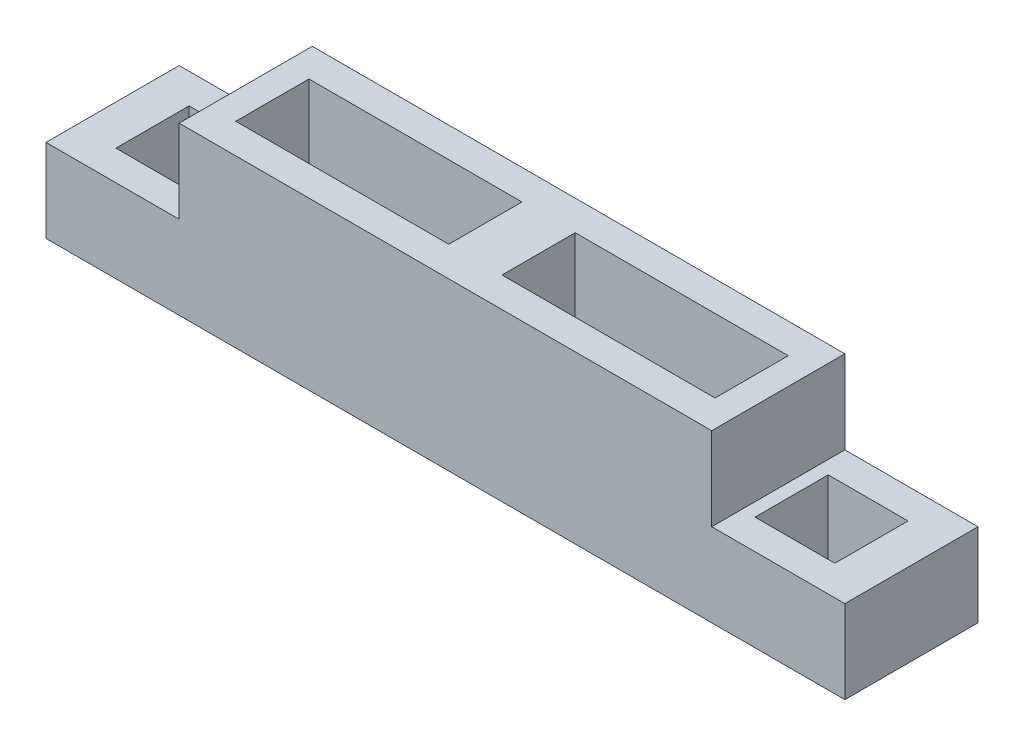
ISO-10303-21;
HEADER;
FILE_DESCRIPTION(('STEP AP214'),'2;1');
FILE_NAME('part.step','',(''),(''),'','','');
FILE_SCHEMA(('AUTOMOTIVE_DESIGN { 1 0 10303 214 1 1 1 1 }'));
ENDSEC;
DATA;
#1=APPLICATION_CONTEXT('core data for automotive mechanical design processes');
#2=APPLICATION_PROTOCOL_DEFINITION('international standard','automotive_design',2000,#1);
#3=PRODUCT_CONTEXT('',#1,'mechanical');
#4=PRODUCT('Part','Part','',(#3));
#5=PRODUCT_RELATED_PRODUCT_CATEGORY('part','',(#4));
#6=PRODUCT_DEFINITION_FORMATION('','',#4);
#7=PRODUCT_DEFINITION_CONTEXT('part definition',#1,'design');
#8=PRODUCT_DEFINITION('design','',#6,#7);
#9=PRODUCT_DEFINITION_SHAPE('','',#8);
#10=(LENGTH_UNIT() NAMED_UNIT(*) SI_UNIT(.MILLI.,.METRE.));
#11=(NAMED_UNIT(*) PLANE_ANGLE_UNIT() SI_UNIT($,.RADIAN.));
#12=(NAMED_UNIT(*) SI_UNIT($,.STERADIAN.) SOLID_ANGLE_UNIT());
#13=UNCERTAINTY_MEASURE_WITH_UNIT(LENGTH_MEASURE(1.E-05),#10,'distance_accuracy_value','');
#14=(GEOMETRIC_REPRESENTATION_CONTEXT(3) GLOBAL_UNCERTAINTY_ASSIGNED_CONTEXT((#13)) GLOBAL_UNIT_ASSIGNED_CONTEXT((#10,
#11,#12)) REPRESENTATION_CONTEXT('',''));
#15=CARTESIAN_POINT('',(0.,0.,0.));
#16=DIRECTION('',(0.,0.,1.));
#17=DIRECTION('',(1.,0.,0.));
#18=AXIS2_PLACEMENT_3D('',#15,#16,#17);
#19=CARTESIAN_POINT('',(0.,250.,0.));
#20=DIRECTION('',(0.,1.,0.));
#21=DIRECTION('',(0.,0.,1.));
#22=AXIS2_PLACEMENT_3D('',#19,#20,#21);
#23=PLANE('',#22);
#24=DIRECTION('',(0.,0.,1.));
#25=VECTOR('',#24,1.);
#26=CARTESIAN_POINT('',(-400.,250.,-100.));
#27=LINE('',#26,#25);
#28=CARTESIAN_POINT('',(-400.,250.,-100.));
#29=VERTEX_POINT('',#28);
#30=CARTESIAN_POINT('',(-400.,250.,100.));
#31=VERTEX_POINT('',#30);
#32=EDGE_CURVE('E247',#29,#31,#27,.T.);
#33=ORIENTED_EDGE('',*,*,#32,.T.);
#34=DIRECTION('',(1.,0.,0.));
#35=VECTOR('',#34,1.);
#36=CARTESIAN_POINT('',(-600.,250.,100.));
#37=LINE('',#36,#35);
#38=CARTESIAN_POINT('',(400.,250.,100.));
#39=VERTEX_POINT('',#38);
#40=EDGE_CURVE('E347',#31,#39,#37,.T.);
#41=ORIENTED_EDGE('',*,*,#40,.T.);
#42=DIRECTION('',(0.,0.,1.));
#43=VECTOR('',#42,1.);
#44=CARTESIAN_POINT('',(400.,250.,-100.));
#45=LINE('',#44,#43);
#46=CARTESIAN_POINT('',(400.,250.,-100.));
#47=VERTEX_POINT('',#46);
#48=EDGE_CURVE('E62',#47,#39,#45,.T.);
#49=ORIENTED_EDGE('',*,*,#48,.F.);
#50=DIRECTION('',(-1.,0.,0.));
#51=VECTOR('',#50,1.);
#52=CARTESIAN_POINT('',(-600.,250.,-99.9999999999999));
#53=LINE('',#52,#51);
#54=EDGE_CURVE('E344',#47,#29,#53,.T.);
#55=ORIENTED_EDGE('',*,*,#54,.T.);
#56=EDGE_LOOP('',(#33,#41,#49,#55));
#57=FACE_BOUND('',#56,.T.);
#58=DIRECTION('',(-1.,0.,0.));
#59=VECTOR('',#58,1.);
#60=CARTESIAN_POINT('',(-360.,250.,-55.));
#61=LINE('',#60,#59);
#62=CARTESIAN_POINT('',(-40.0000000000001,250.,-55.));
#63=VERTEX_POINT('',#62);
#64=CARTESIAN_POINT('',(-360.,250.,-55.));
#65=VERTEX_POINT('',#64);
#66=EDGE_CURVE('E295',#63,#65,#61,.T.);
#67=ORIENTED_EDGE('',*,*,#66,.F.);
#68=DIRECTION('',(0.,0.,-1.));
#69=VECTOR('',#68,1.);
#70=CARTESIAN_POINT('',(-40.0000000000001,250.,-55.));
#71=LINE('',#70,#69);
#72=CARTESIAN_POINT('',(-40.0000000000001,250.,55.));
#73=VERTEX_POINT('',#72);
#74=EDGE_CURVE('E293',#73,#63,#71,.T.);
#75=ORIENTED_EDGE('',*,*,#74,.F.);
#76=DIRECTION('',(1.,0.,0.));
#77=VECTOR('',#76,1.);
#78=CARTESIAN_POINT('',(-360.,250.,55.));
#79=LINE('',#78,#77);
#80=CARTESIAN_POINT('',(-360.,250.,55.));
#81=VERTEX_POINT('',#80);
#82=EDGE_CURVE('E301',#81,#73,#79,.T.);
#83=ORIENTED_EDGE('',*,*,#82,.F.);
#84=DIRECTION('',(0.,0.,1.));
#85=VECTOR('',#84,1.);
#86=CARTESIAN_POINT('',(-360.,250.,-55.));
#87=LINE('',#86,#85);
#88=EDGE_CURVE('E298',#65,#81,#87,.T.);
#89=ORIENTED_EDGE('',*,*,#88,.F.);
#90=EDGE_LOOP('',(#67,#75,#83,#89));
#91=FACE_BOUND('',#90,.T.);
#92=DIRECTION('',(-1.,0.,0.));
#93=VECTOR('',#92,1.);
#94=CARTESIAN_POINT('',(360.,250.,-55.));
#95=LINE('',#94,#93);
#96=CARTESIAN_POINT('',(360.,250.,-55.));
#97=VERTEX_POINT('',#96);
#98=CARTESIAN_POINT('',(40.0000000000001,250.,-55.));
#99=VERTEX_POINT('',#98);
#100=EDGE_CURVE('E264',#97,#99,#95,.T.);
#101=ORIENTED_EDGE('',*,*,#100,.F.);
#102=DIRECTION('',(0.,0.,-1.));
#103=VECTOR('',#102,1.);
#104=CARTESIAN_POINT('',(360.,250.,-55.));
#105=LINE('',#104,#103);
#106=CARTESIAN_POINT('',(360.,250.,55.));
#107=VERTEX_POINT('',#106);
#108=EDGE_CURVE('E262',#107,#97,#105,.T.);
#109=ORIENTED_EDGE('',*,*,#108,.F.);
#110=DIRECTION('',(1.,0.,0.));
#111=VECTOR('',#110,1.);
#112=CARTESIAN_POINT('',(360.,250.,55.));
#113=LINE('',#112,#111);
#114=CARTESIAN_POINT('',(40.0000000000001,250.,55.));
#115=VERTEX_POINT('',#114);
#116=EDGE_CURVE('E270',#115,#107,#113,.T.);
#117=ORIENTED_EDGE('',*,*,#116,.F.);
#118=DIRECTION('',(0.,0.,1.));
#119=VECTOR('',#118,1.);
#120=CARTESIAN_POINT('',(40.0000000000001,250.,-55.));
#121=LINE('',#120,#119);
#122=EDGE_CURVE('E267',#99,#115,#121,.T.);
#123=ORIENTED_EDGE('',*,*,#122,.F.);
#124=EDGE_LOOP('',(#101,#109,#117,#123));
#125=FACE_BOUND('',#124,.T.);
#126=ADVANCED_FACE('F39',(#57,#91,#125),#23,.T.);
#127=CARTESIAN_POINT('',(0.,0.,0.));
#128=DIRECTION('',(0.,1.,0.));
#129=DIRECTION('',(0.,0.,1.));
#130=AXIS2_PLACEMENT_3D('',#127,#128,#129);
#131=PLANE('',#130);
#132=DIRECTION('',(0.,0.,-1.));
#133=VECTOR('',#132,1.);
#134=CARTESIAN_POINT('',(360.,0.,-55.));
#135=LINE('',#134,#133);
#136=CARTESIAN_POINT('',(360.,0.,55.));
#137=VERTEX_POINT('',#136);
#138=CARTESIAN_POINT('',(360.,0.,-55.));
#139=VERTEX_POINT('',#138);
#140=EDGE_CURVE('E261',#137,#139,#135,.T.);
#141=ORIENTED_EDGE('',*,*,#140,.T.);
#142=DIRECTION('',(-1.,0.,0.));
#143=VECTOR('',#142,1.);
#144=CARTESIAN_POINT('',(360.,0.,-55.));
#145=LINE('',#144,#143);
#146=CARTESIAN_POINT('',(40.0000000000001,0.,-55.));
#147=VERTEX_POINT('',#146);
#148=EDGE_CURVE('E275',#139,#147,#145,.T.);
#149=ORIENTED_EDGE('',*,*,#148,.T.);
#150=DIRECTION('',(0.,0.,1.));
#151=VECTOR('',#150,1.);
#152=CARTESIAN_POINT('',(40.0000000000001,0.,-55.));
#153=LINE('',#152,#151);
#154=CARTESIAN_POINT('',(40.0000000000001,0.,55.));
#155=VERTEX_POINT('',#154);
#156=EDGE_CURVE('E278',#147,#155,#153,.T.);
#157=ORIENTED_EDGE('',*,*,#156,.T.);
#158=DIRECTION('',(1.,0.,0.));
#159=VECTOR('',#158,1.);
#160=CARTESIAN_POINT('',(360.,0.,55.));
#161=LINE('',#160,#159);
#162=EDGE_CURVE('E265',#155,#137,#161,.T.);
#163=ORIENTED_EDGE('',*,*,#162,.T.);
#164=EDGE_LOOP('',(#141,#149,#157,#163));
#165=FACE_BOUND('',#164,.T.);
#166=DIRECTION('',(0.,0.,-1.));
#167=VECTOR('',#166,1.);
#168=CARTESIAN_POINT('',(-420.,0.,-55.));
#169=LINE('',#168,#167);
#170=CARTESIAN_POINT('',(-420.,0.,55.));
#171=VERTEX_POINT('',#170);
#172=CARTESIAN_POINT('',(-420.,0.,-55.));
#173=VERTEX_POINT('',#172);
#174=EDGE_CURVE('E323',#171,#173,#169,.T.);
#175=ORIENTED_EDGE('',*,*,#174,.T.);
#176=DIRECTION('',(-1.,0.,0.));
#177=VECTOR('',#176,1.);
#178=CARTESIAN_POINT('',(-540.,0.,-55.));
#179=LINE('',#178,#177);
#180=CARTESIAN_POINT('',(-540.,0.,-55.));
#181=VERTEX_POINT('',#180);
#182=EDGE_CURVE('E326',#173,#181,#179,.T.);
#183=ORIENTED_EDGE('',*,*,#182,.T.);
#184=DIRECTION('',(0.,0.,1.));
#185=VECTOR('',#184,1.);
#186=CARTESIAN_POINT('',(-540.,0.,-55.));
#187=LINE('',#186,#185);
#188=CARTESIAN_POINT('',(-540.,0.,55.));
#189=VERTEX_POINT('',#188);
#190=EDGE_CURVE('E329',#181,#189,#187,.T.);
#191=ORIENTED_EDGE('',*,*,#190,.T.);
#192=DIRECTION('',(1.,0.,0.));
#193=VECTOR('',#192,1.);
#194=CARTESIAN_POINT('',(-540.,0.,55.));
#195=LINE('',#194,#193);
#196=EDGE_CURVE('E332',#189,#171,#195,.T.);
#197=ORIENTED_EDGE('',*,*,#196,.T.);
#198=EDGE_LOOP('',(#175,#183,#191,#197));
#199=FACE_BOUND('',#198,.T.);
#200=DIRECTION('',(0.,0.,-1.));
#201=VECTOR('',#200,1.);
#202=CARTESIAN_POINT('',(600.,0.,-100.));
#203=LINE('',#202,#201);
#204=CARTESIAN_POINT('',(600.,0.,99.9999999999999));
#205=VERTEX_POINT('',#204);
#206=CARTESIAN_POINT('',(600.,0.,-100.));
#207=VERTEX_POINT('',#206);
#208=EDGE_CURVE('E343',#205,#207,#203,.T.);
#209=ORIENTED_EDGE('',*,*,#208,.F.);
#210=DIRECTION('',(1.,0.,0.));
#211=VECTOR('',#210,1.);
#212=CARTESIAN_POINT('',(-600.,0.,100.));
#213=LINE('',#212,#211);
#214=CARTESIAN_POINT('',(-600.,0.,100.));
#215=VERTEX_POINT('',#214);
#216=EDGE_CURVE('E348',#215,#205,#213,.T.);
#217=ORIENTED_EDGE('',*,*,#216,.F.);
#218=DIRECTION('',(0.,0.,1.));
#219=VECTOR('',#218,1.);
#220=CARTESIAN_POINT('',(-600.,0.,-99.9999999999999));
#221=LINE('',#220,#219);
#222=CARTESIAN_POINT('',(-600.,0.,-99.9999999999999));
#223=VERTEX_POINT('',#222);
#224=EDGE_CURVE('E354',#223,#215,#221,.T.);
#225=ORIENTED_EDGE('',*,*,#224,.F.);
#226=DIRECTION('',(-1.,0.,0.));
#227=VECTOR('',#226,1.);
#228=CARTESIAN_POINT('',(-600.,0.,-99.9999999999999));
#229=LINE('',#228,#227);
#230=EDGE_CURVE('E219',#207,#223,#229,.T.);
#231=ORIENTED_EDGE('',*,*,#230,.F.);
#232=EDGE_LOOP('',(#209,#217,#225,#231));
#233=FACE_BOUND('',#232,.T.);
#234=DIRECTION('',(0.,0.,-1.));
#235=VECTOR('',#234,1.);
#236=CARTESIAN_POINT('',(-40.0000000000001,0.,-55.));
#237=LINE('',#236,#235);
#238=CARTESIAN_POINT('',(-40.0000000000001,0.,55.));
#239=VERTEX_POINT('',#238);
#240=CARTESIAN_POINT('',(-40.0000000000001,0.,-55.));
#241=VERTEX_POINT('',#240);
#242=EDGE_CURVE('E292',#239,#241,#237,.T.);
#243=ORIENTED_EDGE('',*,*,#242,.T.);
#244=DIRECTION('',(-1.,0.,0.));
#245=VECTOR('',#244,1.);
#246=CARTESIAN_POINT('',(-360.,0.,-55.));
#247=LINE('',#246,#245);
#248=CARTESIAN_POINT('',(-360.,0.,-55.));
#249=VERTEX_POINT('',#248);
#250=EDGE_CURVE('E306',#241,#249,#247,.T.);
#251=ORIENTED_EDGE('',*,*,#250,.T.);
#252=DIRECTION('',(0.,0.,1.));
#253=VECTOR('',#252,1.);
#254=CARTESIAN_POINT('',(-360.,0.,-55.));
#255=LINE('',#254,#253);
#256=CARTESIAN_POINT('',(-360.,0.,55.));
#257=VERTEX_POINT('',#256);
#258=EDGE_CURVE('E309',#249,#257,#255,.T.);
#259=ORIENTED_EDGE('',*,*,#258,.T.);
#260=DIRECTION('',(1.,0.,0.));
#261=VECTOR('',#260,1.);
#262=CARTESIAN_POINT('',(-360.,0.,55.));
#263=LINE('',#262,#261);
#264=EDGE_CURVE('E296',#257,#239,#263,.T.);
#265=ORIENTED_EDGE('',*,*,#264,.T.);
#266=EDGE_LOOP('',(#243,#251,#259,#265));
#267=FACE_BOUND('',#266,.T.);
#268=DIRECTION('',(0.,0.,-1.));
#269=VECTOR('',#268,1.);
#270=CARTESIAN_POINT('',(540.,0.,-55.));
#271=LINE('',#270,#269);
#272=CARTESIAN_POINT('',(540.,0.,55.));
#273=VERTEX_POINT('',#272);
#274=CARTESIAN_POINT('',(540.,0.,-55.));
#275=VERTEX_POINT('',#274);
#276=EDGE_CURVE('E378',#273,#275,#271,.T.);
#277=ORIENTED_EDGE('',*,*,#276,.T.);
#278=DIRECTION('',(-1.,0.,0.));
#279=VECTOR('',#278,1.);
#280=CARTESIAN_POINT('',(540.,0.,-55.));
#281=LINE('',#280,#279);
#282=CARTESIAN_POINT('',(420.,0.,-55.));
#283=VERTEX_POINT('',#282);
#284=EDGE_CURVE('E380',#275,#283,#281,.T.);
#285=ORIENTED_EDGE('',*,*,#284,.T.);
#286=DIRECTION('',(0.,0.,1.));
#287=VECTOR('',#286,1.);
#288=CARTESIAN_POINT('',(420.,0.,-55.));
#289=LINE('',#288,#287);
#290=CARTESIAN_POINT('',(420.,0.,55.));
#291=VERTEX_POINT('',#290);
#292=EDGE_CURVE('E384',#283,#291,#289,.T.);
#293=ORIENTED_EDGE('',*,*,#292,.T.);
#294=DIRECTION('',(1.,0.,0.));
#295=VECTOR('',#294,1.);
#296=CARTESIAN_POINT('',(540.,0.,55.));
#297=LINE('',#296,#295);
#298=EDGE_CURVE('E251',#291,#273,#297,.T.);
#299=ORIENTED_EDGE('',*,*,#298,.T.);
#300=EDGE_LOOP('',(#277,#285,#293,#299));
#301=FACE_BOUND('',#300,.T.);
#302=ADVANCED_FACE('F369',(#165,#199,#233,#267,#301),#131,.F.);
#303=CARTESIAN_POINT('',(600.,250.,-100.));
#304=DIRECTION('',(-1.,0.,0.));
#305=DIRECTION('',(0.,0.,1.));
#306=AXIS2_PLACEMENT_3D('',#303,#304,#305);
#307=PLANE('',#306);
#308=DIRECTION('',(0.,-1.,0.));
#309=VECTOR('',#308,1.);
#310=CARTESIAN_POINT('',(600.,250.,-100.));
#311=LINE('',#310,#309);
#312=CARTESIAN_POINT('',(600.,125.,-100.));
#313=VERTEX_POINT('',#312);
#314=EDGE_CURVE('E221',#313,#207,#311,.T.);
#315=ORIENTED_EDGE('',*,*,#314,.F.);
#316=DIRECTION('',(0.,0.,1.));
#317=VECTOR('',#316,1.);
#318=CARTESIAN_POINT('',(600.,125.,-100.));
#319=LINE('',#318,#317);
#320=CARTESIAN_POINT('',(600.,125.,100.));
#321=VERTEX_POINT('',#320);
#322=EDGE_CURVE('E362',#313,#321,#319,.T.);
#323=ORIENTED_EDGE('',*,*,#322,.T.);
#324=DIRECTION('',(0.,-1.,0.));
#325=VECTOR('',#324,1.);
#326=CARTESIAN_POINT('',(600.,250.,99.9999999999999));
#327=LINE('',#326,#325);
#328=EDGE_CURVE('E224',#321,#205,#327,.T.);
#329=ORIENTED_EDGE('',*,*,#328,.T.);
#330=ORIENTED_EDGE('',*,*,#208,.T.);
#331=EDGE_LOOP('',(#315,#323,#329,#330));
#332=FACE_BOUND('',#331,.T.);
#333=ADVANCED_FACE('F41',(#332),#307,.F.);
#334=CARTESIAN_POINT('',(-600.,250.,-99.9999999999999));
#335=DIRECTION('',(0.,0.,1.));
#336=DIRECTION('',(1.,0.,0.));
#337=AXIS2_PLACEMENT_3D('',#334,#335,#336);
#338=PLANE('',#337);
#339=DIRECTION('',(1.,0.,0.));
#340=VECTOR('',#339,1.);
#341=CARTESIAN_POINT('',(-600.,125.,-100.));
#342=LINE('',#341,#340);
#343=CARTESIAN_POINT('',(-600.,125.,-100.));
#344=VERTEX_POINT('',#343);
#345=CARTESIAN_POINT('',(-400.,125.,-100.));
#346=VERTEX_POINT('',#345);
#347=EDGE_CURVE('E199',#344,#346,#342,.T.);
#348=ORIENTED_EDGE('',*,*,#347,.T.);
#349=DIRECTION('',(0.,1.,0.));
#350=VECTOR('',#349,1.);
#351=CARTESIAN_POINT('',(-400.,250.,-100.));
#352=LINE('',#351,#350);
#353=EDGE_CURVE('E206',#346,#29,#352,.T.);
#354=ORIENTED_EDGE('',*,*,#353,.T.);
#355=ORIENTED_EDGE('',*,*,#54,.F.);
#356=DIRECTION('',(0.,-1.,0.));
#357=VECTOR('',#356,1.);
#358=CARTESIAN_POINT('',(400.,250.,-100.));
#359=LINE('',#358,#357);
#360=CARTESIAN_POINT('',(400.,125.,-100.));
#361=VERTEX_POINT('',#360);
#362=EDGE_CURVE('E395',#47,#361,#359,.T.);
#363=ORIENTED_EDGE('',*,*,#362,.T.);
#364=DIRECTION('',(1.,0.,0.));
#365=VECTOR('',#364,1.);
#366=CARTESIAN_POINT('',(600.,125.,-100.));
#367=LINE('',#366,#365);
#368=EDGE_CURVE('E399',#361,#313,#367,.T.);
#369=ORIENTED_EDGE('',*,*,#368,.T.);
#370=ORIENTED_EDGE('',*,*,#314,.T.);
#371=ORIENTED_EDGE('',*,*,#230,.T.);
#372=DIRECTION('',(0.,-1.,0.));
#373=VECTOR('',#372,1.);
#374=CARTESIAN_POINT('',(-600.,250.,-99.9999999999999));
#375=LINE('',#374,#373);
#376=EDGE_CURVE('E213',#344,#223,#375,.T.);
#377=ORIENTED_EDGE('',*,*,#376,.F.);
#378=EDGE_LOOP('',(#348,#354,#355,#363,#369,#370,#371,#377));
#379=FACE_BOUND('',#378,.T.);
#380=ADVANCED_FACE('F217',(#379),#338,.F.);
#381=CARTESIAN_POINT('',(-600.,250.,-99.9999999999999));
#382=DIRECTION('',(1.,0.,0.));
#383=DIRECTION('',(0.,0.,-1.));
#384=AXIS2_PLACEMENT_3D('',#381,#382,#383);
#385=PLANE('',#384);
#386=DIRECTION('',(0.,-1.,0.));
#387=VECTOR('',#386,1.);
#388=CARTESIAN_POINT('',(-600.,250.,100.));
#389=LINE('',#388,#387);
#390=CARTESIAN_POINT('',(-600.,125.,100.));
#391=VERTEX_POINT('',#390);
#392=EDGE_CURVE('E215',#391,#215,#389,.T.);
#393=ORIENTED_EDGE('',*,*,#392,.F.);
#394=DIRECTION('',(0.,0.,1.));
#395=VECTOR('',#394,1.);
#396=CARTESIAN_POINT('',(-600.,125.,-100.));
#397=LINE('',#396,#395);
#398=EDGE_CURVE('E54',#344,#391,#397,.T.);
#399=ORIENTED_EDGE('',*,*,#398,.F.);
#400=ORIENTED_EDGE('',*,*,#376,.T.);
#401=ORIENTED_EDGE('',*,*,#224,.T.);
#402=EDGE_LOOP('',(#393,#399,#400,#401));
#403=FACE_BOUND('',#402,.T.);
#404=ADVANCED_FACE('F211',(#403),#385,.F.);
#405=CARTESIAN_POINT('',(-600.,250.,100.));
#406=DIRECTION('',(0.,0.,-1.));
#407=DIRECTION('',(-1.,0.,0.));
#408=AXIS2_PLACEMENT_3D('',#405,#406,#407);
#409=PLANE('',#408);
#410=ORIENTED_EDGE('',*,*,#40,.F.);
#411=DIRECTION('',(0.,1.,0.));
#412=VECTOR('',#411,1.);
#413=CARTESIAN_POINT('',(-400.,250.,100.));
#414=LINE('',#413,#412);
#415=CARTESIAN_POINT('',(-400.,125.,100.));
#416=VERTEX_POINT('',#415);
#417=EDGE_CURVE('E207',#416,#31,#414,.T.);
#418=ORIENTED_EDGE('',*,*,#417,.F.);
#419=DIRECTION('',(1.,0.,0.));
#420=VECTOR('',#419,1.);
#421=CARTESIAN_POINT('',(-600.,125.,100.));
#422=LINE('',#421,#420);
#423=EDGE_CURVE('E404',#391,#416,#422,.T.);
#424=ORIENTED_EDGE('',*,*,#423,.F.);
#425=ORIENTED_EDGE('',*,*,#392,.T.);
#426=ORIENTED_EDGE('',*,*,#216,.T.);
#427=ORIENTED_EDGE('',*,*,#328,.F.);
#428=DIRECTION('',(1.,0.,0.));
#429=VECTOR('',#428,1.);
#430=CARTESIAN_POINT('',(600.,125.,100.));
#431=LINE('',#430,#429);
#432=CARTESIAN_POINT('',(400.,125.,100.));
#433=VERTEX_POINT('',#432);
#434=EDGE_CURVE('E398',#433,#321,#431,.T.);
#435=ORIENTED_EDGE('',*,*,#434,.F.);
#436=DIRECTION('',(0.,-1.,0.));
#437=VECTOR('',#436,1.);
#438=CARTESIAN_POINT('',(400.,250.,100.));
#439=LINE('',#438,#437);
#440=EDGE_CURVE('E402',#39,#433,#439,.T.);
#441=ORIENTED_EDGE('',*,*,#440,.F.);
#442=EDGE_LOOP('',(#410,#418,#424,#425,#426,#427,#435,#441));
#443=FACE_BOUND('',#442,.T.);
#444=ADVANCED_FACE('F367',(#443),#409,.F.);
#445=CARTESIAN_POINT('',(-420.,250.,-55.));
#446=DIRECTION('',(-1.,0.,0.));
#447=DIRECTION('',(0.,0.,1.));
#448=AXIS2_PLACEMENT_3D('',#445,#446,#447);
#449=PLANE('',#448);
#450=DIRECTION('',(0.,0.,1.));
#451=VECTOR('',#450,1.);
#452=CARTESIAN_POINT('',(-420.,125.,-55.));
#453=LINE('',#452,#451);
#454=CARTESIAN_POINT('',(-420.,125.,-55.));
#455=VERTEX_POINT('',#454);
#456=CARTESIAN_POINT('',(-420.,125.,55.));
#457=VERTEX_POINT('',#456);
#458=EDGE_CURVE('E382',#455,#457,#453,.T.);
#459=ORIENTED_EDGE('',*,*,#458,.F.);
#460=DIRECTION('',(0.,-1.,0.));
#461=VECTOR('',#460,1.);
#462=CARTESIAN_POINT('',(-420.,250.,-55.));
#463=LINE('',#462,#461);
#464=EDGE_CURVE('E341',#455,#173,#463,.T.);
#465=ORIENTED_EDGE('',*,*,#464,.T.);
#466=ORIENTED_EDGE('',*,*,#174,.F.);
#467=DIRECTION('',(0.,-1.,0.));
#468=VECTOR('',#467,1.);
#469=CARTESIAN_POINT('',(-420.,250.,55.));
#470=LINE('',#469,#468);
#471=EDGE_CURVE('E335',#457,#171,#470,.T.);
#472=ORIENTED_EDGE('',*,*,#471,.F.);
#473=EDGE_LOOP('',(#459,#465,#466,#472));
#474=FACE_BOUND('',#473,.T.);
#475=ADVANCED_FACE('F436',(#474),#449,.T.);
#476=CARTESIAN_POINT('',(-540.,250.,-55.));
#477=DIRECTION('',(0.,0.,1.));
#478=DIRECTION('',(1.,0.,0.));
#479=AXIS2_PLACEMENT_3D('',#476,#477,#478);
#480=PLANE('',#479);
#481=DIRECTION('',(1.,0.,0.));
#482=VECTOR('',#481,1.);
#483=CARTESIAN_POINT('',(-540.,125.,-55.));
#484=LINE('',#483,#482);
#485=CARTESIAN_POINT('',(-540.,125.,-55.));
#486=VERTEX_POINT('',#485);
#487=EDGE_CURVE('E386',#486,#455,#484,.T.);
#488=ORIENTED_EDGE('',*,*,#487,.F.);
#489=DIRECTION('',(0.,-1.,0.));
#490=VECTOR('',#489,1.);
#491=CARTESIAN_POINT('',(-540.,250.,-55.));
#492=LINE('',#491,#490);
#493=EDGE_CURVE('E339',#486,#181,#492,.T.);
#494=ORIENTED_EDGE('',*,*,#493,.T.);
#495=ORIENTED_EDGE('',*,*,#182,.F.);
#496=ORIENTED_EDGE('',*,*,#464,.F.);
#497=EDGE_LOOP('',(#488,#494,#495,#496));
#498=FACE_BOUND('',#497,.T.);
#499=ADVANCED_FACE('F584',(#498),#480,.T.);
#500=CARTESIAN_POINT('',(-540.,250.,-55.));
#501=DIRECTION('',(1.,0.,0.));
#502=DIRECTION('',(0.,0.,-1.));
#503=AXIS2_PLACEMENT_3D('',#500,#501,#502);
#504=PLANE('',#503);
#505=DIRECTION('',(0.,0.,-1.));
#506=VECTOR('',#505,1.);
#507=CARTESIAN_POINT('',(-540.,125.,-55.));
#508=LINE('',#507,#506);
#509=CARTESIAN_POINT('',(-540.,125.,55.));
#510=VERTEX_POINT('',#509);
#511=EDGE_CURVE('E391',#510,#486,#508,.T.);
#512=ORIENTED_EDGE('',*,*,#511,.F.);
#513=DIRECTION('',(0.,-1.,0.));
#514=VECTOR('',#513,1.);
#515=CARTESIAN_POINT('',(-540.,250.,55.));
#516=LINE('',#515,#514);
#517=EDGE_CURVE('E337',#510,#189,#516,.T.);
#518=ORIENTED_EDGE('',*,*,#517,.T.);
#519=ORIENTED_EDGE('',*,*,#190,.F.);
#520=ORIENTED_EDGE('',*,*,#493,.F.);
#521=EDGE_LOOP('',(#512,#518,#519,#520));
#522=FACE_BOUND('',#521,.T.);
#523=ADVANCED_FACE('F593',(#522),#504,.T.);
#524=CARTESIAN_POINT('',(-540.,250.,55.));
#525=DIRECTION('',(0.,0.,-1.));
#526=DIRECTION('',(-1.,0.,0.));
#527=AXIS2_PLACEMENT_3D('',#524,#525,#526);
#528=PLANE('',#527);
#529=DIRECTION('',(-1.,0.,0.));
#530=VECTOR('',#529,1.);
#531=CARTESIAN_POINT('',(-540.,125.,55.));
#532=LINE('',#531,#530);
#533=EDGE_CURVE('E11',#457,#510,#532,.T.);
#534=ORIENTED_EDGE('',*,*,#533,.F.);
#535=ORIENTED_EDGE('',*,*,#471,.T.);
#536=ORIENTED_EDGE('',*,*,#196,.F.);
#537=ORIENTED_EDGE('',*,*,#517,.F.);
#538=EDGE_LOOP('',(#534,#535,#536,#537));
#539=FACE_BOUND('',#538,.T.);
#540=ADVANCED_FACE('F465',(#539),#528,.T.);
#541=CARTESIAN_POINT('',(-40.0000000000001,250.,-55.));
#542=DIRECTION('',(-1.,0.,0.));
#543=DIRECTION('',(0.,0.,1.));
#544=AXIS2_PLACEMENT_3D('',#541,#542,#543);
#545=PLANE('',#544);
#546=ORIENTED_EDGE('',*,*,#242,.F.);
#547=DIRECTION('',(0.,-1.,0.));
#548=VECTOR('',#547,1.);
#549=CARTESIAN_POINT('',(-40.0000000000001,250.,55.));
#550=LINE('',#549,#548);
#551=EDGE_CURVE('E303',#73,#239,#550,.T.);
#552=ORIENTED_EDGE('',*,*,#551,.F.);
#553=ORIENTED_EDGE('',*,*,#74,.T.);
#554=DIRECTION('',(0.,-1.,0.));
#555=VECTOR('',#554,1.);
#556=CARTESIAN_POINT('',(-40.0000000000001,250.,-55.));
#557=LINE('',#556,#555);
#558=EDGE_CURVE('E320',#63,#241,#557,.T.);
#559=ORIENTED_EDGE('',*,*,#558,.T.);
#560=EDGE_LOOP('',(#546,#552,#553,#559));
#561=FACE_BOUND('',#560,.T.);
#562=ADVANCED_FACE('F459',(#561),#545,.T.);
#563=CARTESIAN_POINT('',(-360.,250.,-55.));
#564=DIRECTION('',(0.,0.,1.));
#565=DIRECTION('',(1.,0.,0.));
#566=AXIS2_PLACEMENT_3D('',#563,#564,#565);
#567=PLANE('',#566);
#568=ORIENTED_EDGE('',*,*,#250,.F.);
#569=ORIENTED_EDGE('',*,*,#558,.F.);
#570=ORIENTED_EDGE('',*,*,#66,.T.);
#571=DIRECTION('',(0.,-1.,0.));
#572=VECTOR('',#571,1.);
#573=CARTESIAN_POINT('',(-360.,250.,-55.));
#574=LINE('',#573,#572);
#575=EDGE_CURVE('E318',#65,#249,#574,.T.);
#576=ORIENTED_EDGE('',*,*,#575,.T.);
#577=EDGE_LOOP('',(#568,#569,#570,#576));
#578=FACE_BOUND('',#577,.T.);
#579=ADVANCED_FACE('F464',(#578),#567,.T.);
#580=CARTESIAN_POINT('',(-360.,250.,-55.));
#581=DIRECTION('',(1.,0.,0.));
#582=DIRECTION('',(0.,0.,-1.));
#583=AXIS2_PLACEMENT_3D('',#580,#581,#582);
#584=PLANE('',#583);
#585=ORIENTED_EDGE('',*,*,#258,.F.);
#586=ORIENTED_EDGE('',*,*,#575,.F.);
#587=ORIENTED_EDGE('',*,*,#88,.T.);
#588=DIRECTION('',(0.,-1.,0.));
#589=VECTOR('',#588,1.);
#590=CARTESIAN_POINT('',(-360.,250.,55.));
#591=LINE('',#590,#589);
#592=EDGE_CURVE('E316',#81,#257,#591,.T.);
#593=ORIENTED_EDGE('',*,*,#592,.T.);
#594=EDGE_LOOP('',(#585,#586,#587,#593));
#595=FACE_BOUND('',#594,.T.);
#596=ADVANCED_FACE('F478',(#595),#584,.T.);
#597=CARTESIAN_POINT('',(-360.,250.,55.));
#598=DIRECTION('',(0.,0.,-1.));
#599=DIRECTION('',(-1.,0.,0.));
#600=AXIS2_PLACEMENT_3D('',#597,#598,#599);
#601=PLANE('',#600);
#602=ORIENTED_EDGE('',*,*,#264,.F.);
#603=ORIENTED_EDGE('',*,*,#592,.F.);
#604=ORIENTED_EDGE('',*,*,#82,.T.);
#605=ORIENTED_EDGE('',*,*,#551,.T.);
#606=EDGE_LOOP('',(#602,#603,#604,#605));
#607=FACE_BOUND('',#606,.T.);
#608=ADVANCED_FACE('F489',(#607),#601,.T.);
#609=CARTESIAN_POINT('',(360.,250.,-55.));
#610=DIRECTION('',(-1.,0.,0.));
#611=DIRECTION('',(0.,0.,1.));
#612=AXIS2_PLACEMENT_3D('',#609,#610,#611);
#613=PLANE('',#612);
#614=ORIENTED_EDGE('',*,*,#140,.F.);
#615=DIRECTION('',(0.,-1.,0.));
#616=VECTOR('',#615,1.);
#617=CARTESIAN_POINT('',(360.,250.,55.));
#618=LINE('',#617,#616);
#619=EDGE_CURVE('E272',#107,#137,#618,.T.);
#620=ORIENTED_EDGE('',*,*,#619,.F.);
#621=ORIENTED_EDGE('',*,*,#108,.T.);
#622=DIRECTION('',(0.,-1.,0.));
#623=VECTOR('',#622,1.);
#624=CARTESIAN_POINT('',(360.,250.,-55.));
#625=LINE('',#624,#623);
#626=EDGE_CURVE('E289',#97,#139,#625,.T.);
#627=ORIENTED_EDGE('',*,*,#626,.T.);
#628=EDGE_LOOP('',(#614,#620,#621,#627));
#629=FACE_BOUND('',#628,.T.);
#630=ADVANCED_FACE('F500',(#629),#613,.T.);
#631=CARTESIAN_POINT('',(360.,250.,-55.));
#632=DIRECTION('',(0.,0.,1.));
#633=DIRECTION('',(1.,0.,0.));
#634=AXIS2_PLACEMENT_3D('',#631,#632,#633);
#635=PLANE('',#634);
#636=ORIENTED_EDGE('',*,*,#148,.F.);
#637=ORIENTED_EDGE('',*,*,#626,.F.);
#638=ORIENTED_EDGE('',*,*,#100,.T.);
#639=DIRECTION('',(0.,-1.,0.));
#640=VECTOR('',#639,1.);
#641=CARTESIAN_POINT('',(40.0000000000001,250.,-55.));
#642=LINE('',#641,#640);
#643=EDGE_CURVE('E287',#99,#147,#642,.T.);
#644=ORIENTED_EDGE('',*,*,#643,.T.);
#645=EDGE_LOOP('',(#636,#637,#638,#644));
#646=FACE_BOUND('',#645,.T.);
#647=ADVANCED_FACE('F511',(#646),#635,.T.);
#648=CARTESIAN_POINT('',(40.0000000000001,250.,-55.));
#649=DIRECTION('',(1.,0.,0.));
#650=DIRECTION('',(0.,0.,-1.));
#651=AXIS2_PLACEMENT_3D('',#648,#649,#650);
#652=PLANE('',#651);
#653=ORIENTED_EDGE('',*,*,#156,.F.);
#654=ORIENTED_EDGE('',*,*,#643,.F.);
#655=ORIENTED_EDGE('',*,*,#122,.T.);
#656=DIRECTION('',(0.,-1.,0.));
#657=VECTOR('',#656,1.);
#658=CARTESIAN_POINT('',(40.0000000000001,250.,55.));
#659=LINE('',#658,#657);
#660=EDGE_CURVE('E285',#115,#155,#659,.T.);
#661=ORIENTED_EDGE('',*,*,#660,.T.);
#662=EDGE_LOOP('',(#653,#654,#655,#661));
#663=FACE_BOUND('',#662,.T.);
#664=ADVANCED_FACE('F522',(#663),#652,.T.);
#665=CARTESIAN_POINT('',(360.,250.,55.));
#666=DIRECTION('',(0.,0.,-1.));
#667=DIRECTION('',(-1.,0.,0.));
#668=AXIS2_PLACEMENT_3D('',#665,#666,#667);
#669=PLANE('',#668);
#670=ORIENTED_EDGE('',*,*,#162,.F.);
#671=ORIENTED_EDGE('',*,*,#660,.F.);
#672=ORIENTED_EDGE('',*,*,#116,.T.);
#673=ORIENTED_EDGE('',*,*,#619,.T.);
#674=EDGE_LOOP('',(#670,#671,#672,#673));
#675=FACE_BOUND('',#674,.T.);
#676=ADVANCED_FACE('F533',(#675),#669,.T.);
#677=CARTESIAN_POINT('',(540.,250.,-55.));
#678=DIRECTION('',(-1.,0.,0.));
#679=DIRECTION('',(0.,0.,1.));
#680=AXIS2_PLACEMENT_3D('',#677,#678,#679);
#681=PLANE('',#680);
#682=DIRECTION('',(0.,0.,1.));
#683=VECTOR('',#682,1.);
#684=CARTESIAN_POINT('',(540.,125.,-55.));
#685=LINE('',#684,#683);
#686=CARTESIAN_POINT('',(540.,125.,-55.));
#687=VERTEX_POINT('',#686);
#688=CARTESIAN_POINT('',(540.,125.,55.));
#689=VERTEX_POINT('',#688);
#690=EDGE_CURVE('E235',#687,#689,#685,.T.);
#691=ORIENTED_EDGE('',*,*,#690,.F.);
#692=DIRECTION('',(0.,-1.,0.));
#693=VECTOR('',#692,1.);
#694=CARTESIAN_POINT('',(540.,250.,-55.));
#695=LINE('',#694,#693);
#696=EDGE_CURVE('E255',#687,#275,#695,.T.);
#697=ORIENTED_EDGE('',*,*,#696,.T.);
#698=ORIENTED_EDGE('',*,*,#276,.F.);
#699=DIRECTION('',(0.,-1.,0.));
#700=VECTOR('',#699,1.);
#701=CARTESIAN_POINT('',(540.,250.,55.));
#702=LINE('',#701,#700);
#703=EDGE_CURVE('E253',#689,#273,#702,.T.);
#704=ORIENTED_EDGE('',*,*,#703,.F.);
#705=EDGE_LOOP('',(#691,#697,#698,#704));
#706=FACE_BOUND('',#705,.T.);
#707=ADVANCED_FACE('F543',(#706),#681,.T.);
#708=CARTESIAN_POINT('',(540.,250.,-55.));
#709=DIRECTION('',(0.,0.,1.));
#710=DIRECTION('',(1.,0.,0.));
#711=AXIS2_PLACEMENT_3D('',#708,#709,#710);
#712=PLANE('',#711);
#713=DIRECTION('',(1.,0.,0.));
#714=VECTOR('',#713,1.);
#715=CARTESIAN_POINT('',(540.,125.,-55.));
#716=LINE('',#715,#714);
#717=CARTESIAN_POINT('',(420.,125.,-55.));
#718=VERTEX_POINT('',#717);
#719=EDGE_CURVE('E246',#718,#687,#716,.T.);
#720=ORIENTED_EDGE('',*,*,#719,.F.);
#721=DIRECTION('',(0.,-1.,0.));
#722=VECTOR('',#721,1.);
#723=CARTESIAN_POINT('',(420.,250.,-55.));
#724=LINE('',#723,#722);
#725=EDGE_CURVE('E245',#718,#283,#724,.T.);
#726=ORIENTED_EDGE('',*,*,#725,.T.);
#727=ORIENTED_EDGE('',*,*,#284,.F.);
#728=ORIENTED_EDGE('',*,*,#696,.F.);
#729=EDGE_LOOP('',(#720,#726,#727,#728));
#730=FACE_BOUND('',#729,.T.);
#731=ADVANCED_FACE('F624',(#730),#712,.T.);
#732=CARTESIAN_POINT('',(420.,250.,-55.));
#733=DIRECTION('',(1.,0.,0.));
#734=DIRECTION('',(0.,0.,-1.));
#735=AXIS2_PLACEMENT_3D('',#732,#733,#734);
#736=PLANE('',#735);
#737=DIRECTION('',(0.,0.,-1.));
#738=VECTOR('',#737,1.);
#739=CARTESIAN_POINT('',(420.,125.,-55.));
#740=LINE('',#739,#738);
#741=CARTESIAN_POINT('',(420.,125.,55.));
#742=VERTEX_POINT('',#741);
#743=EDGE_CURVE('E232',#742,#718,#740,.T.);
#744=ORIENTED_EDGE('',*,*,#743,.F.);
#745=DIRECTION('',(0.,-1.,0.));
#746=VECTOR('',#745,1.);
#747=CARTESIAN_POINT('',(420.,250.,55.));
#748=LINE('',#747,#746);
#749=EDGE_CURVE('E243',#742,#291,#748,.T.);
#750=ORIENTED_EDGE('',*,*,#749,.T.);
#751=ORIENTED_EDGE('',*,*,#292,.F.);
#752=ORIENTED_EDGE('',*,*,#725,.F.);
#753=EDGE_LOOP('',(#744,#750,#751,#752));
#754=FACE_BOUND('',#753,.T.);
#755=ADVANCED_FACE('F241',(#754),#736,.T.);
#756=CARTESIAN_POINT('',(540.,250.,55.));
#757=DIRECTION('',(0.,0.,-1.));
#758=DIRECTION('',(-1.,0.,0.));
#759=AXIS2_PLACEMENT_3D('',#756,#757,#758);
#760=PLANE('',#759);
#761=DIRECTION('',(-1.,0.,0.));
#762=VECTOR('',#761,1.);
#763=CARTESIAN_POINT('',(540.,125.,55.));
#764=LINE('',#763,#762);
#765=EDGE_CURVE('E47',#689,#742,#764,.T.);
#766=ORIENTED_EDGE('',*,*,#765,.F.);
#767=ORIENTED_EDGE('',*,*,#703,.T.);
#768=ORIENTED_EDGE('',*,*,#298,.F.);
#769=ORIENTED_EDGE('',*,*,#749,.F.);
#770=EDGE_LOOP('',(#766,#767,#768,#769));
#771=FACE_BOUND('',#770,.T.);
#772=ADVANCED_FACE('F249',(#771),#760,.T.);
#773=CARTESIAN_POINT('',(600.,125.,-100.));
#774=DIRECTION('',(0.,-1.,0.));
#775=DIRECTION('',(1.,0.,0.));
#776=AXIS2_PLACEMENT_3D('',#773,#774,#775);
#777=PLANE('',#776);
#778=ORIENTED_EDGE('',*,*,#690,.T.);
#779=ORIENTED_EDGE('',*,*,#765,.T.);
#780=ORIENTED_EDGE('',*,*,#743,.T.);
#781=ORIENTED_EDGE('',*,*,#719,.T.);
#782=EDGE_LOOP('',(#778,#779,#780,#781));
#783=FACE_BOUND('',#782,.T.);
#784=ORIENTED_EDGE('',*,*,#434,.T.);
#785=ORIENTED_EDGE('',*,*,#322,.F.);
#786=ORIENTED_EDGE('',*,*,#368,.F.);
#787=DIRECTION('',(0.,0.,1.));
#788=VECTOR('',#787,1.);
#789=CARTESIAN_POINT('',(400.,125.,-100.));
#790=LINE('',#789,#788);
#791=EDGE_CURVE('E407',#361,#433,#790,.T.);
#792=ORIENTED_EDGE('',*,*,#791,.T.);
#793=EDGE_LOOP('',(#784,#785,#786,#792));
#794=FACE_BOUND('',#793,.T.);
#795=ADVANCED_FACE('F230',(#783,#794),#777,.F.);
#796=CARTESIAN_POINT('',(400.,250.,-100.));
#797=DIRECTION('',(-1.,0.,0.));
#798=DIRECTION('',(0.,-1.,0.));
#799=AXIS2_PLACEMENT_3D('',#796,#797,#798);
#800=PLANE('',#799);
#801=ORIENTED_EDGE('',*,*,#440,.T.);
#802=ORIENTED_EDGE('',*,*,#791,.F.);
#803=ORIENTED_EDGE('',*,*,#362,.F.);
#804=ORIENTED_EDGE('',*,*,#48,.T.);
#805=EDGE_LOOP('',(#801,#802,#803,#804));
#806=FACE_BOUND('',#805,.T.);
#807=ADVANCED_FACE('F420',(#806),#800,.F.);
#808=CARTESIAN_POINT('',(-400.,250.,-100.));
#809=DIRECTION('',(1.,0.,0.));
#810=DIRECTION('',(0.,1.,0.));
#811=AXIS2_PLACEMENT_3D('',#808,#809,#810);
#812=PLANE('',#811);
#813=ORIENTED_EDGE('',*,*,#417,.T.);
#814=ORIENTED_EDGE('',*,*,#32,.F.);
#815=ORIENTED_EDGE('',*,*,#353,.F.);
#816=DIRECTION('',(0.,0.,1.));
#817=VECTOR('',#816,1.);
#818=CARTESIAN_POINT('',(-400.,125.,-100.));
#819=LINE('',#818,#817);
#820=EDGE_CURVE('E201',#346,#416,#819,.T.);
#821=ORIENTED_EDGE('',*,*,#820,.T.);
#822=EDGE_LOOP('',(#813,#814,#815,#821));
#823=FACE_BOUND('',#822,.T.);
#824=ADVANCED_FACE('F428',(#823),#812,.F.);
#825=CARTESIAN_POINT('',(-600.,125.,-100.));
#826=DIRECTION('',(0.,-1.,0.));
#827=DIRECTION('',(0.,0.,-1.));
#828=AXIS2_PLACEMENT_3D('',#825,#826,#827);
#829=PLANE('',#828);
#830=ORIENTED_EDGE('',*,*,#458,.T.);
#831=ORIENTED_EDGE('',*,*,#533,.T.);
#832=ORIENTED_EDGE('',*,*,#511,.T.);
#833=ORIENTED_EDGE('',*,*,#487,.T.);
#834=EDGE_LOOP('',(#830,#831,#832,#833));
#835=FACE_BOUND('',#834,.T.);
#836=ORIENTED_EDGE('',*,*,#423,.T.);
#837=ORIENTED_EDGE('',*,*,#820,.F.);
#838=ORIENTED_EDGE('',*,*,#347,.F.);
#839=ORIENTED_EDGE('',*,*,#398,.T.);
#840=EDGE_LOOP('',(#836,#837,#838,#839));
#841=FACE_BOUND('',#840,.T.);
#842=ADVANCED_FACE('F200',(#835,#841),#829,.F.);
#843=CLOSED_SHELL('',(#126,#302,#333,#380,#404,#444,#475,#499,#523,#540,#562,#579,#596,#608,
#630,#647,#664,#676,#707,#731,#755,#772,#795,#807,#824,#842));
#844=MANIFOLD_SOLID_BREP('B2',#843);
#845=ADVANCED_BREP_SHAPE_REPRESENTATION('',(#18,#844),#14);
#846=SHAPE_DEFINITION_REPRESENTATION(#9,#845);
ENDSEC;
END-ISO-10303-21;
